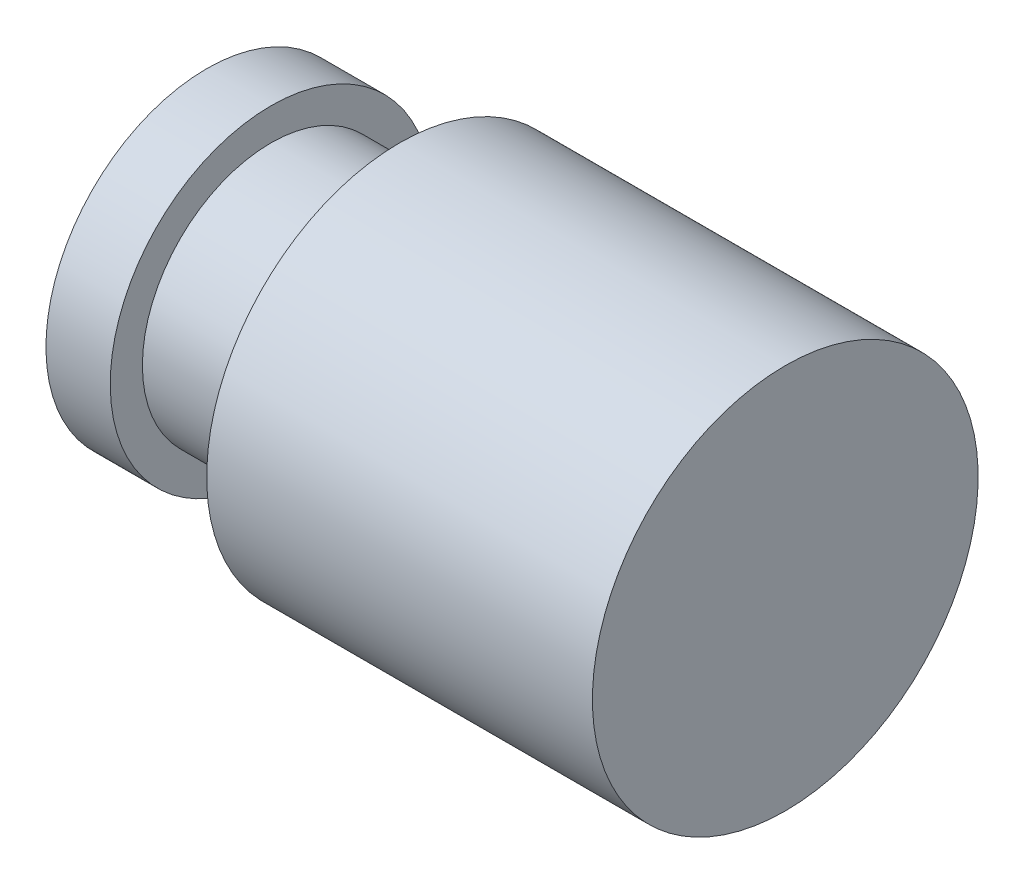
ISO-10303-21;
HEADER;
FILE_DESCRIPTION(('STEP AP214'),'2;1');
FILE_NAME('part.step','',(''),(''),'','','');
FILE_SCHEMA(('AUTOMOTIVE_DESIGN { 1 0 10303 214 1 1 1 1 }'));
ENDSEC;
DATA;
#1=APPLICATION_CONTEXT('core data for automotive mechanical design processes');
#2=APPLICATION_PROTOCOL_DEFINITION('international standard','automotive_design',2000,#1);
#3=PRODUCT_CONTEXT('',#1,'mechanical');
#4=PRODUCT('Part','Part','',(#3));
#5=PRODUCT_RELATED_PRODUCT_CATEGORY('part','',(#4));
#6=PRODUCT_DEFINITION_FORMATION('','',#4);
#7=PRODUCT_DEFINITION_CONTEXT('part definition',#1,'design');
#8=PRODUCT_DEFINITION('design','',#6,#7);
#9=PRODUCT_DEFINITION_SHAPE('','',#8);
#10=(LENGTH_UNIT() NAMED_UNIT(*) SI_UNIT(.MILLI.,.METRE.));
#11=(NAMED_UNIT(*) PLANE_ANGLE_UNIT() SI_UNIT($,.RADIAN.));
#12=(NAMED_UNIT(*) SI_UNIT($,.STERADIAN.) SOLID_ANGLE_UNIT());
#13=UNCERTAINTY_MEASURE_WITH_UNIT(LENGTH_MEASURE(1.E-05),#10,'distance_accuracy_value','');
#14=(GEOMETRIC_REPRESENTATION_CONTEXT(3) GLOBAL_UNCERTAINTY_ASSIGNED_CONTEXT((#13)) GLOBAL_UNIT_ASSIGNED_CONTEXT((#10,
#11,#12)) REPRESENTATION_CONTEXT('',''));
#15=CARTESIAN_POINT('',(0.,0.,0.));
#16=DIRECTION('',(0.,0.,1.));
#17=DIRECTION('',(1.,0.,0.));
#18=AXIS2_PLACEMENT_3D('',#15,#16,#17);
#19=CARTESIAN_POINT('',(0.,0.,0.));
#20=DIRECTION('',(-1.,0.,0.));
#21=DIRECTION('',(0.,-1.,0.));
#22=AXIS2_PLACEMENT_3D('',#19,#20,#21);
#23=PLANE('',#22);
#24=CARTESIAN_POINT('',(0.,0.,0.));
#25=DIRECTION('',(1.,0.,0.));
#26=DIRECTION('',(0.,1.,0.));
#27=AXIS2_PLACEMENT_3D('',#24,#25,#26);
#28=CIRCLE('',#27,2.5);
#29=CARTESIAN_POINT('',(0.,2.5,0.));
#30=VERTEX_POINT('',#29);
#31=EDGE_CURVE('E10',#30,#30,#28,.T.);
#32=ORIENTED_EDGE('',*,*,#31,.F.);
#33=EDGE_LOOP('',(#32));
#34=FACE_BOUND('',#33,.T.);
#35=ADVANCED_FACE('F32',(#34),#23,.T.);
#36=CARTESIAN_POINT('',(9.,0.,0.));
#37=DIRECTION('',(1.,0.,0.));
#38=DIRECTION('',(0.,1.,0.));
#39=AXIS2_PLACEMENT_3D('',#36,#37,#38);
#40=CYLINDRICAL_SURFACE('',#39,2.5);
#41=ORIENTED_EDGE('',*,*,#31,.T.);
#42=EDGE_LOOP('',(#41));
#43=FACE_BOUND('',#42,.T.);
#44=CARTESIAN_POINT('',(1.,0.,0.));
#45=DIRECTION('',(1.,0.,0.));
#46=DIRECTION('',(0.,1.,0.));
#47=AXIS2_PLACEMENT_3D('',#44,#45,#46);
#48=CIRCLE('',#47,2.5);
#49=CARTESIAN_POINT('',(1.,2.5,0.));
#50=VERTEX_POINT('',#49);
#51=EDGE_CURVE('E38',#50,#50,#48,.T.);
#52=ORIENTED_EDGE('',*,*,#51,.F.);
#53=EDGE_LOOP('',(#52));
#54=FACE_BOUND('',#53,.T.);
#55=ADVANCED_FACE('F74',(#43,#54),#40,.T.);
#56=CARTESIAN_POINT('',(1.,2.5,0.));
#57=DIRECTION('',(1.,0.,0.));
#58=DIRECTION('',(0.,1.,0.));
#59=AXIS2_PLACEMENT_3D('',#56,#57,#58);
#60=PLANE('',#59);
#61=ORIENTED_EDGE('',*,*,#51,.T.);
#62=EDGE_LOOP('',(#61));
#63=FACE_BOUND('',#62,.T.);
#64=CARTESIAN_POINT('',(1.,0.,0.));
#65=DIRECTION('',(1.,0.,0.));
#66=DIRECTION('',(0.,1.,0.));
#67=AXIS2_PLACEMENT_3D('',#64,#65,#66);
#68=CIRCLE('',#67,2.);
#69=CARTESIAN_POINT('',(1.,2.,0.));
#70=VERTEX_POINT('',#69);
#71=EDGE_CURVE('E42',#70,#70,#68,.T.);
#72=ORIENTED_EDGE('',*,*,#71,.F.);
#73=EDGE_LOOP('',(#72));
#74=FACE_BOUND('',#73,.T.);
#75=ADVANCED_FACE('F79',(#63,#74),#60,.T.);
#76=CARTESIAN_POINT('',(9.,0.,0.));
#77=DIRECTION('',(1.,0.,0.));
#78=DIRECTION('',(0.,1.,0.));
#79=AXIS2_PLACEMENT_3D('',#76,#77,#78);
#80=CYLINDRICAL_SURFACE('',#79,2.);
#81=ORIENTED_EDGE('',*,*,#71,.T.);
#82=EDGE_LOOP('',(#81));
#83=FACE_BOUND('',#82,.T.);
#84=CARTESIAN_POINT('',(3.,0.,0.));
#85=DIRECTION('',(1.,0.,0.));
#86=DIRECTION('',(0.,1.,0.));
#87=AXIS2_PLACEMENT_3D('',#84,#85,#86);
#88=CIRCLE('',#87,2.);
#89=CARTESIAN_POINT('',(3.,2.,0.));
#90=VERTEX_POINT('',#89);
#91=EDGE_CURVE('E46',#90,#90,#88,.T.);
#92=ORIENTED_EDGE('',*,*,#91,.F.);
#93=EDGE_LOOP('',(#92));
#94=FACE_BOUND('',#93,.T.);
#95=ADVANCED_FACE('F70',(#83,#94),#80,.T.);
#96=CARTESIAN_POINT('',(3.,2.,0.));
#97=DIRECTION('',(-1.,0.,0.));
#98=DIRECTION('',(0.,-1.,0.));
#99=AXIS2_PLACEMENT_3D('',#96,#97,#98);
#100=PLANE('',#99);
#101=ORIENTED_EDGE('',*,*,#91,.T.);
#102=EDGE_LOOP('',(#101));
#103=FACE_BOUND('',#102,.T.);
#104=CARTESIAN_POINT('',(3.,0.,0.));
#105=DIRECTION('',(1.,0.,0.));
#106=DIRECTION('',(0.,1.,0.));
#107=AXIS2_PLACEMENT_3D('',#104,#105,#106);
#108=CIRCLE('',#107,3.);
#109=CARTESIAN_POINT('',(3.,3.,0.));
#110=VERTEX_POINT('',#109);
#111=EDGE_CURVE('E51',#110,#110,#108,.T.);
#112=ORIENTED_EDGE('',*,*,#111,.F.);
#113=EDGE_LOOP('',(#112));
#114=FACE_BOUND('',#113,.T.);
#115=ADVANCED_FACE('F62',(#103,#114),#100,.T.);
#116=CARTESIAN_POINT('',(9.,0.,0.));
#117=DIRECTION('',(1.,0.,0.));
#118=DIRECTION('',(0.,1.,0.));
#119=AXIS2_PLACEMENT_3D('',#116,#117,#118);
#120=CYLINDRICAL_SURFACE('',#119,3.);
#121=ORIENTED_EDGE('',*,*,#111,.T.);
#122=EDGE_LOOP('',(#121));
#123=FACE_BOUND('',#122,.T.);
#124=CARTESIAN_POINT('',(9.,0.,0.));
#125=DIRECTION('',(1.,0.,0.));
#126=DIRECTION('',(0.,1.,0.));
#127=AXIS2_PLACEMENT_3D('',#124,#125,#126);
#128=CIRCLE('',#127,3.);
#129=CARTESIAN_POINT('',(9.,3.,0.));
#130=VERTEX_POINT('',#129);
#131=EDGE_CURVE('E54',#130,#130,#128,.T.);
#132=ORIENTED_EDGE('',*,*,#131,.F.);
#133=EDGE_LOOP('',(#132));
#134=FACE_BOUND('',#133,.T.);
#135=ADVANCED_FACE('F60',(#123,#134),#120,.T.);
#136=CARTESIAN_POINT('',(9.,2.,0.));
#137=DIRECTION('',(1.,0.,0.));
#138=DIRECTION('',(0.,1.,0.));
#139=AXIS2_PLACEMENT_3D('',#136,#137,#138);
#140=PLANE('',#139);
#141=ORIENTED_EDGE('',*,*,#131,.T.);
#142=EDGE_LOOP('',(#141));
#143=FACE_BOUND('',#142,.T.);
#144=ADVANCED_FACE('F58',(#143),#140,.T.);
#145=CLOSED_SHELL('',(#35,#55,#75,#95,#115,#135,#144));
#146=MANIFOLD_SOLID_BREP('B2',#145);
#147=ADVANCED_BREP_SHAPE_REPRESENTATION('',(#18,#146),#14);
#148=SHAPE_DEFINITION_REPRESENTATION(#9,#147);
ENDSEC;
END-ISO-10303-21;
